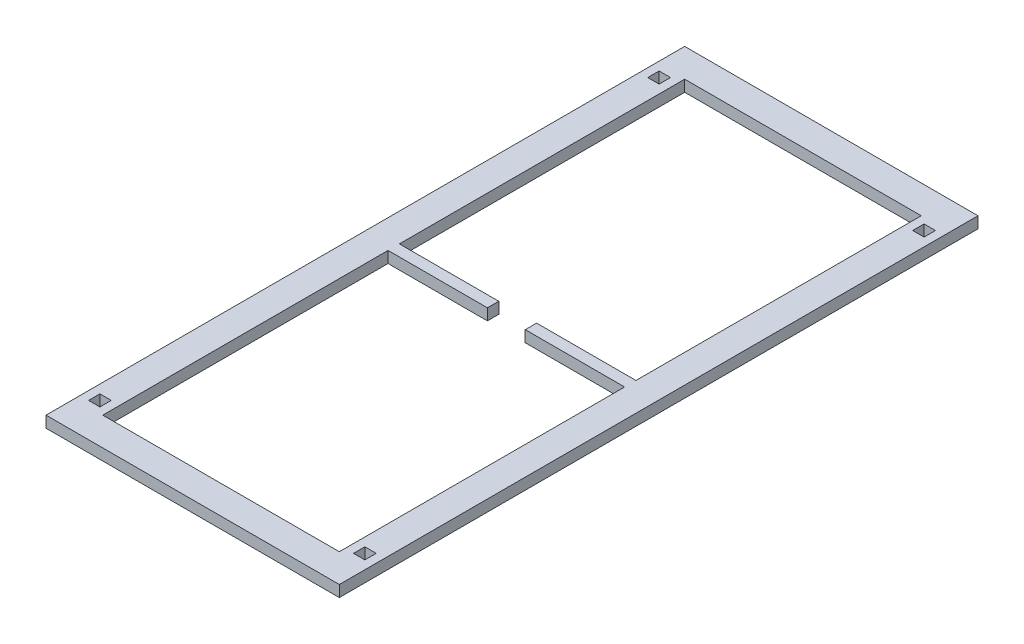
ISO-10303-21;
HEADER;
FILE_DESCRIPTION(('STEP AP214'),'2;1');
FILE_NAME('part.step','',(''),(''),'','','');
FILE_SCHEMA(('AUTOMOTIVE_DESIGN { 1 0 10303 214 1 1 1 1 }'));
ENDSEC;
DATA;
#1=APPLICATION_CONTEXT('core data for automotive mechanical design processes');
#2=APPLICATION_PROTOCOL_DEFINITION('international standard','automotive_design',2000,#1);
#3=PRODUCT_CONTEXT('',#1,'mechanical');
#4=PRODUCT('Part','Part','',(#3));
#5=PRODUCT_RELATED_PRODUCT_CATEGORY('part','',(#4));
#6=PRODUCT_DEFINITION_FORMATION('','',#4);
#7=PRODUCT_DEFINITION_CONTEXT('part definition',#1,'design');
#8=PRODUCT_DEFINITION('design','',#6,#7);
#9=PRODUCT_DEFINITION_SHAPE('','',#8);
#10=(LENGTH_UNIT() NAMED_UNIT(*) SI_UNIT(.MILLI.,.METRE.));
#11=(NAMED_UNIT(*) PLANE_ANGLE_UNIT() SI_UNIT($,.RADIAN.));
#12=(NAMED_UNIT(*) SI_UNIT($,.STERADIAN.) SOLID_ANGLE_UNIT());
#13=UNCERTAINTY_MEASURE_WITH_UNIT(LENGTH_MEASURE(1.E-05),#10,'distance_accuracy_value','');
#14=(GEOMETRIC_REPRESENTATION_CONTEXT(3) GLOBAL_UNCERTAINTY_ASSIGNED_CONTEXT((#13)) GLOBAL_UNIT_ASSIGNED_CONTEXT((#10,
#11,#12)) REPRESENTATION_CONTEXT('',''));
#15=CARTESIAN_POINT('',(0.,0.,0.));
#16=DIRECTION('',(0.,0.,1.));
#17=DIRECTION('',(1.,0.,0.));
#18=AXIS2_PLACEMENT_3D('',#15,#16,#17);
#19=CARTESIAN_POINT('',(125.,12.,0.));
#20=DIRECTION('',(-1.,0.,0.));
#21=DIRECTION('',(0.,0.,1.));
#22=AXIS2_PLACEMENT_3D('',#19,#20,#21);
#23=PLANE('',#22);
#24=DIRECTION('',(0.,0.,-1.));
#25=VECTOR('',#24,1.);
#26=CARTESIAN_POINT('',(125.,0.,0.));
#27=LINE('',#26,#25);
#28=CARTESIAN_POINT('',(125.,0.,-6.));
#29=VERTEX_POINT('',#28);
#30=CARTESIAN_POINT('',(125.,0.,-307.5));
#31=VERTEX_POINT('',#30);
#32=EDGE_CURVE('E66',#29,#31,#27,.T.);
#33=ORIENTED_EDGE('',*,*,#32,.F.);
#34=DIRECTION('',(0.,1.,0.));
#35=VECTOR('',#34,1.);
#36=CARTESIAN_POINT('',(125.,0.,-6.));
#37=LINE('',#36,#35);
#38=CARTESIAN_POINT('',(125.,12.,-6.));
#39=VERTEX_POINT('',#38);
#40=EDGE_CURVE('E290',#29,#39,#37,.T.);
#41=ORIENTED_EDGE('',*,*,#40,.T.);
#42=DIRECTION('',(0.,0.,-1.));
#43=VECTOR('',#42,1.);
#44=CARTESIAN_POINT('',(125.,12.,0.));
#45=LINE('',#44,#43);
#46=CARTESIAN_POINT('',(125.,12.,-307.5));
#47=VERTEX_POINT('',#46);
#48=EDGE_CURVE('E459',#39,#47,#45,.T.);
#49=ORIENTED_EDGE('',*,*,#48,.T.);
#50=DIRECTION('',(0.,-1.,0.));
#51=VECTOR('',#50,1.);
#52=CARTESIAN_POINT('',(125.,12.,-307.5));
#53=LINE('',#52,#51);
#54=EDGE_CURVE('E492',#47,#31,#53,.T.);
#55=ORIENTED_EDGE('',*,*,#54,.T.);
#56=EDGE_LOOP('',(#33,#41,#49,#55));
#57=FACE_BOUND('',#56,.T.);
#58=ADVANCED_FACE('F41',(#57),#23,.T.);
#59=CARTESIAN_POINT('',(-125.,12.,0.));
#60=DIRECTION('',(-1.,0.,0.));
#61=DIRECTION('',(0.,0.,1.));
#62=AXIS2_PLACEMENT_3D('',#59,#60,#61);
#63=PLANE('',#62);
#64=DIRECTION('',(0.,1.,0.));
#65=VECTOR('',#64,1.);
#66=CARTESIAN_POINT('',(-125.,0.,-6.));
#67=LINE('',#66,#65);
#68=CARTESIAN_POINT('',(-125.,0.,-6.));
#69=VERTEX_POINT('',#68);
#70=CARTESIAN_POINT('',(-125.,12.,-6.));
#71=VERTEX_POINT('',#70);
#72=EDGE_CURVE('E314',#69,#71,#67,.T.);
#73=ORIENTED_EDGE('',*,*,#72,.F.);
#74=DIRECTION('',(0.,0.,-1.));
#75=VECTOR('',#74,1.);
#76=CARTESIAN_POINT('',(-125.,0.,0.));
#77=LINE('',#76,#75);
#78=CARTESIAN_POINT('',(-125.,0.,-307.5));
#79=VERTEX_POINT('',#78);
#80=EDGE_CURVE('E486',#69,#79,#77,.T.);
#81=ORIENTED_EDGE('',*,*,#80,.T.);
#82=DIRECTION('',(0.,-1.,0.));
#83=VECTOR('',#82,1.);
#84=CARTESIAN_POINT('',(-125.,12.,-307.5));
#85=LINE('',#84,#83);
#86=CARTESIAN_POINT('',(-125.,12.,-307.5));
#87=VERTEX_POINT('',#86);
#88=EDGE_CURVE('E494',#87,#79,#85,.T.);
#89=ORIENTED_EDGE('',*,*,#88,.F.);
#90=DIRECTION('',(0.,0.,-1.));
#91=VECTOR('',#90,1.);
#92=CARTESIAN_POINT('',(-125.,12.,0.));
#93=LINE('',#92,#91);
#94=EDGE_CURVE('E464',#71,#87,#93,.T.);
#95=ORIENTED_EDGE('',*,*,#94,.F.);
#96=EDGE_LOOP('',(#73,#81,#89,#95));
#97=FACE_BOUND('',#96,.T.);
#98=ADVANCED_FACE('F530',(#97),#63,.F.);
#99=CARTESIAN_POINT('',(0.,12.,0.));
#100=DIRECTION('',(0.,1.,0.));
#101=DIRECTION('',(0.,0.,1.));
#102=AXIS2_PLACEMENT_3D('',#99,#100,#101);
#103=PLANE('',#102);
#104=DIRECTION('',(-1.,0.,0.));
#105=VECTOR('',#104,1.);
#106=CARTESIAN_POINT('',(0.,12.,337.5));
#107=LINE('',#106,#105);
#108=CARTESIAN_POINT('',(155.,12.,337.5));
#109=VERTEX_POINT('',#108);
#110=CARTESIAN_POINT('',(-155.,12.,337.5));
#111=VERTEX_POINT('',#110);
#112=EDGE_CURVE('E448',#109,#111,#107,.T.);
#113=ORIENTED_EDGE('',*,*,#112,.F.);
#114=DIRECTION('',(0.,0.,-1.));
#115=VECTOR('',#114,1.);
#116=CARTESIAN_POINT('',(155.,12.,0.));
#117=LINE('',#116,#115);
#118=CARTESIAN_POINT('',(155.,12.,-337.5));
#119=VERTEX_POINT('',#118);
#120=EDGE_CURVE('E451',#109,#119,#117,.T.);
#121=ORIENTED_EDGE('',*,*,#120,.T.);
#122=DIRECTION('',(-1.,0.,0.));
#123=VECTOR('',#122,1.);
#124=CARTESIAN_POINT('',(0.,12.,-337.5));
#125=LINE('',#124,#123);
#126=CARTESIAN_POINT('',(-155.,12.,-337.5));
#127=VERTEX_POINT('',#126);
#128=EDGE_CURVE('E454',#119,#127,#125,.T.);
#129=ORIENTED_EDGE('',*,*,#128,.T.);
#130=DIRECTION('',(0.,0.,-1.));
#131=VECTOR('',#130,1.);
#132=CARTESIAN_POINT('',(-155.,12.,0.));
#133=LINE('',#132,#131);
#134=EDGE_CURVE('E456',#111,#127,#133,.T.);
#135=ORIENTED_EDGE('',*,*,#134,.F.);
#136=EDGE_LOOP('',(#113,#121,#129,#135));
#137=FACE_BOUND('',#136,.T.);
#138=CARTESIAN_POINT('',(125.,12.,307.5));
#139=VERTEX_POINT('',#138);
#140=CARTESIAN_POINT('',(125.,12.,6.));
#141=VERTEX_POINT('',#140);
#142=EDGE_CURVE('E58',#139,#141,#45,.T.);
#143=ORIENTED_EDGE('',*,*,#142,.F.);
#144=DIRECTION('',(-1.,0.,0.));
#145=VECTOR('',#144,1.);
#146=CARTESIAN_POINT('',(0.,12.,307.5));
#147=LINE('',#146,#145);
#148=CARTESIAN_POINT('',(-125.,12.,307.5));
#149=VERTEX_POINT('',#148);
#150=EDGE_CURVE('E461',#139,#149,#147,.T.);
#151=ORIENTED_EDGE('',*,*,#150,.T.);
#152=CARTESIAN_POINT('',(-125.,12.,6.));
#153=VERTEX_POINT('',#152);
#154=EDGE_CURVE('E465',#149,#153,#93,.T.);
#155=ORIENTED_EDGE('',*,*,#154,.T.);
#156=DIRECTION('',(1.,0.,0.));
#157=VECTOR('',#156,1.);
#158=CARTESIAN_POINT('',(0.,12.,6.));
#159=LINE('',#158,#157);
#160=CARTESIAN_POINT('',(-20.,12.,6.));
#161=VERTEX_POINT('',#160);
#162=EDGE_CURVE('E289',#153,#161,#159,.T.);
#163=ORIENTED_EDGE('',*,*,#162,.T.);
#164=DIRECTION('',(0.,0.,-1.));
#165=VECTOR('',#164,1.);
#166=CARTESIAN_POINT('',(-20.,12.,0.));
#167=LINE('',#166,#165);
#168=CARTESIAN_POINT('',(-20.,12.,-6.));
#169=VERTEX_POINT('',#168);
#170=EDGE_CURVE('E305',#161,#169,#167,.T.);
#171=ORIENTED_EDGE('',*,*,#170,.T.);
#172=DIRECTION('',(1.,0.,0.));
#173=VECTOR('',#172,1.);
#174=CARTESIAN_POINT('',(0.,12.,-6.));
#175=LINE('',#174,#173);
#176=EDGE_CURVE('E297',#71,#169,#175,.T.);
#177=ORIENTED_EDGE('',*,*,#176,.F.);
#178=ORIENTED_EDGE('',*,*,#94,.T.);
#179=DIRECTION('',(-1.,0.,0.));
#180=VECTOR('',#179,1.);
#181=CARTESIAN_POINT('',(0.,12.,-307.5));
#182=LINE('',#181,#180);
#183=EDGE_CURVE('E468',#47,#87,#182,.T.);
#184=ORIENTED_EDGE('',*,*,#183,.F.);
#185=ORIENTED_EDGE('',*,*,#48,.F.);
#186=DIRECTION('',(1.,0.,0.));
#187=VECTOR('',#186,1.);
#188=CARTESIAN_POINT('',(0.,12.,-6.));
#189=LINE('',#188,#187);
#190=CARTESIAN_POINT('',(20.,12.,-6.));
#191=VERTEX_POINT('',#190);
#192=EDGE_CURVE('E272',#191,#39,#189,.T.);
#193=ORIENTED_EDGE('',*,*,#192,.F.);
#194=DIRECTION('',(0.,0.,-1.));
#195=VECTOR('',#194,1.);
#196=CARTESIAN_POINT('',(20.,12.,0.));
#197=LINE('',#196,#195);
#198=CARTESIAN_POINT('',(20.,12.,6.));
#199=VERTEX_POINT('',#198);
#200=EDGE_CURVE('E283',#199,#191,#197,.T.);
#201=ORIENTED_EDGE('',*,*,#200,.F.);
#202=DIRECTION('',(1.,0.,0.));
#203=VECTOR('',#202,1.);
#204=CARTESIAN_POINT('',(0.,12.,6.));
#205=LINE('',#204,#203);
#206=EDGE_CURVE('E258',#199,#141,#205,.T.);
#207=ORIENTED_EDGE('',*,*,#206,.T.);
#208=EDGE_LOOP('',(#143,#151,#155,#163,#171,#177,#178,#184,#185,#193,#201,#207));
#209=FACE_BOUND('',#208,.T.);
#210=DIRECTION('',(1.,0.,0.));
#211=VECTOR('',#210,1.);
#212=CARTESIAN_POINT('',(0.,12.,289.5));
#213=LINE('',#212,#211);
#214=CARTESIAN_POINT('',(-146.,12.,289.5));
#215=VERTEX_POINT('',#214);
#216=CARTESIAN_POINT('',(-134.,12.,289.5));
#217=VERTEX_POINT('',#216);
#218=EDGE_CURVE('E399',#215,#217,#213,.T.);
#219=ORIENTED_EDGE('',*,*,#218,.T.);
#220=DIRECTION('',(0.,0.,1.));
#221=VECTOR('',#220,1.);
#222=CARTESIAN_POINT('',(-134.,12.,0.));
#223=LINE('',#222,#221);
#224=CARTESIAN_POINT('',(-134.,12.,301.5));
#225=VERTEX_POINT('',#224);
#226=EDGE_CURVE('E408',#217,#225,#223,.T.);
#227=ORIENTED_EDGE('',*,*,#226,.T.);
#228=DIRECTION('',(-1.,0.,0.));
#229=VECTOR('',#228,1.);
#230=CARTESIAN_POINT('',(0.,12.,301.5));
#231=LINE('',#230,#229);
#232=CARTESIAN_POINT('',(-146.,12.,301.5));
#233=VERTEX_POINT('',#232);
#234=EDGE_CURVE('E405',#225,#233,#231,.T.);
#235=ORIENTED_EDGE('',*,*,#234,.T.);
#236=DIRECTION('',(0.,0.,-1.));
#237=VECTOR('',#236,1.);
#238=CARTESIAN_POINT('',(-146.,12.,0.));
#239=LINE('',#238,#237);
#240=EDGE_CURVE('E402',#233,#215,#239,.T.);
#241=ORIENTED_EDGE('',*,*,#240,.T.);
#242=EDGE_LOOP('',(#219,#227,#235,#241));
#243=FACE_BOUND('',#242,.T.);
#244=DIRECTION('',(1.,0.,0.));
#245=VECTOR('',#244,1.);
#246=CARTESIAN_POINT('',(0.,12.,-301.5));
#247=LINE('',#246,#245);
#248=CARTESIAN_POINT('',(-146.,12.,-301.5));
#249=VERTEX_POINT('',#248);
#250=CARTESIAN_POINT('',(-134.,12.,-301.5));
#251=VERTEX_POINT('',#250);
#252=EDGE_CURVE('E411',#249,#251,#247,.T.);
#253=ORIENTED_EDGE('',*,*,#252,.T.);
#254=DIRECTION('',(0.,0.,1.));
#255=VECTOR('',#254,1.);
#256=CARTESIAN_POINT('',(-134.,12.,0.));
#257=LINE('',#256,#255);
#258=CARTESIAN_POINT('',(-134.,12.,-289.5));
#259=VERTEX_POINT('',#258);
#260=EDGE_CURVE('E420',#251,#259,#257,.T.);
#261=ORIENTED_EDGE('',*,*,#260,.T.);
#262=DIRECTION('',(-1.,0.,0.));
#263=VECTOR('',#262,1.);
#264=CARTESIAN_POINT('',(0.,12.,-289.5));
#265=LINE('',#264,#263);
#266=CARTESIAN_POINT('',(-146.,12.,-289.5));
#267=VERTEX_POINT('',#266);
#268=EDGE_CURVE('E417',#259,#267,#265,.T.);
#269=ORIENTED_EDGE('',*,*,#268,.T.);
#270=DIRECTION('',(0.,0.,-1.));
#271=VECTOR('',#270,1.);
#272=CARTESIAN_POINT('',(-146.,12.,0.));
#273=LINE('',#272,#271);
#274=EDGE_CURVE('E414',#267,#249,#273,.T.);
#275=ORIENTED_EDGE('',*,*,#274,.T.);
#276=EDGE_LOOP('',(#253,#261,#269,#275));
#277=FACE_BOUND('',#276,.T.);
#278=DIRECTION('',(1.,0.,0.));
#279=VECTOR('',#278,1.);
#280=CARTESIAN_POINT('',(0.,12.,-301.5));
#281=LINE('',#280,#279);
#282=CARTESIAN_POINT('',(134.,12.,-301.5));
#283=VERTEX_POINT('',#282);
#284=CARTESIAN_POINT('',(146.,12.,-301.5));
#285=VERTEX_POINT('',#284);
#286=EDGE_CURVE('E423',#283,#285,#281,.T.);
#287=ORIENTED_EDGE('',*,*,#286,.T.);
#288=DIRECTION('',(0.,0.,1.));
#289=VECTOR('',#288,1.);
#290=CARTESIAN_POINT('',(146.,12.,0.));
#291=LINE('',#290,#289);
#292=CARTESIAN_POINT('',(146.,12.,-289.5));
#293=VERTEX_POINT('',#292);
#294=EDGE_CURVE('E432',#285,#293,#291,.T.);
#295=ORIENTED_EDGE('',*,*,#294,.T.);
#296=DIRECTION('',(-1.,0.,0.));
#297=VECTOR('',#296,1.);
#298=CARTESIAN_POINT('',(0.,12.,-289.5));
#299=LINE('',#298,#297);
#300=CARTESIAN_POINT('',(134.,12.,-289.5));
#301=VERTEX_POINT('',#300);
#302=EDGE_CURVE('E429',#293,#301,#299,.T.);
#303=ORIENTED_EDGE('',*,*,#302,.T.);
#304=DIRECTION('',(0.,0.,-1.));
#305=VECTOR('',#304,1.);
#306=CARTESIAN_POINT('',(134.,12.,0.));
#307=LINE('',#306,#305);
#308=EDGE_CURVE('E426',#301,#283,#307,.T.);
#309=ORIENTED_EDGE('',*,*,#308,.T.);
#310=EDGE_LOOP('',(#287,#295,#303,#309));
#311=FACE_BOUND('',#310,.T.);
#312=DIRECTION('',(1.,0.,0.));
#313=VECTOR('',#312,1.);
#314=CARTESIAN_POINT('',(0.,12.,289.5));
#315=LINE('',#314,#313);
#316=CARTESIAN_POINT('',(134.,12.,289.5));
#317=VERTEX_POINT('',#316);
#318=CARTESIAN_POINT('',(146.,12.,289.5));
#319=VERTEX_POINT('',#318);
#320=EDGE_CURVE('E435',#317,#319,#315,.T.);
#321=ORIENTED_EDGE('',*,*,#320,.T.);
#322=DIRECTION('',(0.,0.,1.));
#323=VECTOR('',#322,1.);
#324=CARTESIAN_POINT('',(146.,12.,0.));
#325=LINE('',#324,#323);
#326=CARTESIAN_POINT('',(146.,12.,301.5));
#327=VERTEX_POINT('',#326);
#328=EDGE_CURVE('E444',#319,#327,#325,.T.);
#329=ORIENTED_EDGE('',*,*,#328,.T.);
#330=DIRECTION('',(-1.,0.,0.));
#331=VECTOR('',#330,1.);
#332=CARTESIAN_POINT('',(0.,12.,301.5));
#333=LINE('',#332,#331);
#334=CARTESIAN_POINT('',(134.,12.,301.5));
#335=VERTEX_POINT('',#334);
#336=EDGE_CURVE('E441',#327,#335,#333,.T.);
#337=ORIENTED_EDGE('',*,*,#336,.T.);
#338=DIRECTION('',(0.,0.,-1.));
#339=VECTOR('',#338,1.);
#340=CARTESIAN_POINT('',(134.,12.,0.));
#341=LINE('',#340,#339);
#342=EDGE_CURVE('E438',#335,#317,#341,.T.);
#343=ORIENTED_EDGE('',*,*,#342,.T.);
#344=EDGE_LOOP('',(#321,#329,#337,#343));
#345=FACE_BOUND('',#344,.T.);
#346=ADVANCED_FACE('F536',(#137,#209,#243,#277,#311,#345),#103,.T.);
#347=CARTESIAN_POINT('',(0.,0.,0.));
#348=DIRECTION('',(0.,1.,0.));
#349=DIRECTION('',(0.,0.,1.));
#350=AXIS2_PLACEMENT_3D('',#347,#348,#349);
#351=PLANE('',#350);
#352=DIRECTION('',(0.,0.,1.));
#353=VECTOR('',#352,1.);
#354=CARTESIAN_POINT('',(146.,0.,0.));
#355=LINE('',#354,#353);
#356=CARTESIAN_POINT('',(146.,0.,-301.5));
#357=VERTEX_POINT('',#356);
#358=CARTESIAN_POINT('',(146.,0.,-289.5));
#359=VERTEX_POINT('',#358);
#360=EDGE_CURVE('E324',#357,#359,#355,.T.);
#361=ORIENTED_EDGE('',*,*,#360,.F.);
#362=DIRECTION('',(1.,0.,0.));
#363=VECTOR('',#362,1.);
#364=CARTESIAN_POINT('',(0.,0.,-301.5));
#365=LINE('',#364,#363);
#366=CARTESIAN_POINT('',(134.,0.,-301.5));
#367=VERTEX_POINT('',#366);
#368=EDGE_CURVE('E354',#367,#357,#365,.T.);
#369=ORIENTED_EDGE('',*,*,#368,.F.);
#370=DIRECTION('',(0.,0.,-1.));
#371=VECTOR('',#370,1.);
#372=CARTESIAN_POINT('',(134.,0.,0.));
#373=LINE('',#372,#371);
#374=CARTESIAN_POINT('',(134.,0.,-289.5));
#375=VERTEX_POINT('',#374);
#376=EDGE_CURVE('E356',#375,#367,#373,.T.);
#377=ORIENTED_EDGE('',*,*,#376,.F.);
#378=DIRECTION('',(-1.,0.,0.));
#379=VECTOR('',#378,1.);
#380=CARTESIAN_POINT('',(0.,0.,-289.5));
#381=LINE('',#380,#379);
#382=EDGE_CURVE('E359',#359,#375,#381,.T.);
#383=ORIENTED_EDGE('',*,*,#382,.F.);
#384=EDGE_LOOP('',(#361,#369,#377,#383));
#385=FACE_BOUND('',#384,.T.);
#386=DIRECTION('',(0.,0.,1.));
#387=VECTOR('',#386,1.);
#388=CARTESIAN_POINT('',(-134.,0.,0.));
#389=LINE('',#388,#387);
#390=CARTESIAN_POINT('',(-134.,0.,289.5));
#391=VERTEX_POINT('',#390);
#392=CARTESIAN_POINT('',(-134.,0.,301.5));
#393=VERTEX_POINT('',#392);
#394=EDGE_CURVE('E341',#391,#393,#389,.T.);
#395=ORIENTED_EDGE('',*,*,#394,.F.);
#396=DIRECTION('',(1.,0.,0.));
#397=VECTOR('',#396,1.);
#398=CARTESIAN_POINT('',(0.,0.,289.5));
#399=LINE('',#398,#397);
#400=CARTESIAN_POINT('',(-146.,0.,289.5));
#401=VERTEX_POINT('',#400);
#402=EDGE_CURVE('E386',#401,#391,#399,.T.);
#403=ORIENTED_EDGE('',*,*,#402,.F.);
#404=DIRECTION('',(0.,0.,-1.));
#405=VECTOR('',#404,1.);
#406=CARTESIAN_POINT('',(-146.,0.,0.));
#407=LINE('',#406,#405);
#408=CARTESIAN_POINT('',(-146.,0.,301.5));
#409=VERTEX_POINT('',#408);
#410=EDGE_CURVE('E383',#409,#401,#407,.T.);
#411=ORIENTED_EDGE('',*,*,#410,.F.);
#412=DIRECTION('',(-1.,0.,0.));
#413=VECTOR('',#412,1.);
#414=CARTESIAN_POINT('',(0.,0.,301.5));
#415=LINE('',#414,#413);
#416=EDGE_CURVE('E381',#393,#409,#415,.T.);
#417=ORIENTED_EDGE('',*,*,#416,.F.);
#418=EDGE_LOOP('',(#395,#403,#411,#417));
#419=FACE_BOUND('',#418,.T.);
#420=DIRECTION('',(-1.,0.,0.));
#421=VECTOR('',#420,1.);
#422=CARTESIAN_POINT('',(0.,0.,337.5));
#423=LINE('',#422,#421);
#424=CARTESIAN_POINT('',(155.,0.,337.5));
#425=VERTEX_POINT('',#424);
#426=CARTESIAN_POINT('',(-155.,0.,337.5));
#427=VERTEX_POINT('',#426);
#428=EDGE_CURVE('E447',#425,#427,#423,.T.);
#429=ORIENTED_EDGE('',*,*,#428,.T.);
#430=DIRECTION('',(0.,0.,-1.));
#431=VECTOR('',#430,1.);
#432=CARTESIAN_POINT('',(-155.,0.,0.));
#433=LINE('',#432,#431);
#434=CARTESIAN_POINT('',(-155.,0.,-337.5));
#435=VERTEX_POINT('',#434);
#436=EDGE_CURVE('E479',#427,#435,#433,.T.);
#437=ORIENTED_EDGE('',*,*,#436,.T.);
#438=DIRECTION('',(-1.,0.,0.));
#439=VECTOR('',#438,1.);
#440=CARTESIAN_POINT('',(0.,0.,-337.5));
#441=LINE('',#440,#439);
#442=CARTESIAN_POINT('',(155.,0.,-337.5));
#443=VERTEX_POINT('',#442);
#444=EDGE_CURVE('E476',#443,#435,#441,.T.);
#445=ORIENTED_EDGE('',*,*,#444,.F.);
#446=DIRECTION('',(0.,0.,-1.));
#447=VECTOR('',#446,1.);
#448=CARTESIAN_POINT('',(155.,0.,0.));
#449=LINE('',#448,#447);
#450=EDGE_CURVE('E474',#425,#443,#449,.T.);
#451=ORIENTED_EDGE('',*,*,#450,.F.);
#452=EDGE_LOOP('',(#429,#437,#445,#451));
#453=FACE_BOUND('',#452,.T.);
#454=CARTESIAN_POINT('',(125.,0.,307.5));
#455=VERTEX_POINT('',#454);
#456=CARTESIAN_POINT('',(125.,0.,6.));
#457=VERTEX_POINT('',#456);
#458=EDGE_CURVE('E279',#455,#457,#27,.T.);
#459=ORIENTED_EDGE('',*,*,#458,.T.);
#460=DIRECTION('',(1.,0.,0.));
#461=VECTOR('',#460,1.);
#462=CARTESIAN_POINT('',(0.,0.,6.));
#463=LINE('',#462,#461);
#464=CARTESIAN_POINT('',(20.,0.,6.));
#465=VERTEX_POINT('',#464);
#466=EDGE_CURVE('E256',#465,#457,#463,.T.);
#467=ORIENTED_EDGE('',*,*,#466,.F.);
#468=DIRECTION('',(0.,0.,-1.));
#469=VECTOR('',#468,1.);
#470=CARTESIAN_POINT('',(20.,0.,0.));
#471=LINE('',#470,#469);
#472=CARTESIAN_POINT('',(20.,0.,-6.));
#473=VERTEX_POINT('',#472);
#474=EDGE_CURVE('E267',#465,#473,#471,.T.);
#475=ORIENTED_EDGE('',*,*,#474,.T.);
#476=DIRECTION('',(1.,0.,0.));
#477=VECTOR('',#476,1.);
#478=CARTESIAN_POINT('',(0.,0.,-6.));
#479=LINE('',#478,#477);
#480=EDGE_CURVE('E263',#473,#29,#479,.T.);
#481=ORIENTED_EDGE('',*,*,#480,.T.);
#482=ORIENTED_EDGE('',*,*,#32,.T.);
#483=DIRECTION('',(-1.,0.,0.));
#484=VECTOR('',#483,1.);
#485=CARTESIAN_POINT('',(0.,0.,-307.5));
#486=LINE('',#485,#484);
#487=EDGE_CURVE('E452',#31,#79,#486,.T.);
#488=ORIENTED_EDGE('',*,*,#487,.T.);
#489=ORIENTED_EDGE('',*,*,#80,.F.);
#490=DIRECTION('',(1.,0.,0.));
#491=VECTOR('',#490,1.);
#492=CARTESIAN_POINT('',(0.,0.,-6.));
#493=LINE('',#492,#491);
#494=CARTESIAN_POINT('',(-20.,0.,-6.));
#495=VERTEX_POINT('',#494);
#496=EDGE_CURVE('E300',#69,#495,#493,.T.);
#497=ORIENTED_EDGE('',*,*,#496,.T.);
#498=DIRECTION('',(0.,0.,-1.));
#499=VECTOR('',#498,1.);
#500=CARTESIAN_POINT('',(-20.,0.,0.));
#501=LINE('',#500,#499);
#502=CARTESIAN_POINT('',(-20.,0.,6.));
#503=VERTEX_POINT('',#502);
#504=EDGE_CURVE('E296',#503,#495,#501,.T.);
#505=ORIENTED_EDGE('',*,*,#504,.F.);
#506=DIRECTION('',(1.,0.,0.));
#507=VECTOR('',#506,1.);
#508=CARTESIAN_POINT('',(0.,0.,6.));
#509=LINE('',#508,#507);
#510=CARTESIAN_POINT('',(-125.,0.,6.));
#511=VERTEX_POINT('',#510);
#512=EDGE_CURVE('E293',#511,#503,#509,.T.);
#513=ORIENTED_EDGE('',*,*,#512,.F.);
#514=CARTESIAN_POINT('',(-125.,0.,307.5));
#515=VERTEX_POINT('',#514);
#516=EDGE_CURVE('E487',#515,#511,#77,.T.);
#517=ORIENTED_EDGE('',*,*,#516,.F.);
#518=DIRECTION('',(-1.,0.,0.));
#519=VECTOR('',#518,1.);
#520=CARTESIAN_POINT('',(0.,0.,307.5));
#521=LINE('',#520,#519);
#522=EDGE_CURVE('E483',#455,#515,#521,.T.);
#523=ORIENTED_EDGE('',*,*,#522,.F.);
#524=EDGE_LOOP('',(#459,#467,#475,#481,#482,#488,#489,#497,#505,#513,#517,#523));
#525=FACE_BOUND('',#524,.T.);
#526=DIRECTION('',(0.,0.,1.));
#527=VECTOR('',#526,1.);
#528=CARTESIAN_POINT('',(-134.,0.,0.));
#529=LINE('',#528,#527);
#530=CARTESIAN_POINT('',(-134.,0.,-301.5));
#531=VERTEX_POINT('',#530);
#532=CARTESIAN_POINT('',(-134.,0.,-289.5));
#533=VERTEX_POINT('',#532);
#534=EDGE_CURVE('E339',#531,#533,#529,.T.);
#535=ORIENTED_EDGE('',*,*,#534,.F.);
#536=DIRECTION('',(1.,0.,0.));
#537=VECTOR('',#536,1.);
#538=CARTESIAN_POINT('',(0.,0.,-301.5));
#539=LINE('',#538,#537);
#540=CARTESIAN_POINT('',(-146.,0.,-301.5));
#541=VERTEX_POINT('',#540);
#542=EDGE_CURVE('E332',#541,#531,#539,.T.);
#543=ORIENTED_EDGE('',*,*,#542,.F.);
#544=DIRECTION('',(0.,0.,-1.));
#545=VECTOR('',#544,1.);
#546=CARTESIAN_POINT('',(-146.,0.,0.));
#547=LINE('',#546,#545);
#548=CARTESIAN_POINT('',(-146.,0.,-289.5));
#549=VERTEX_POINT('',#548);
#550=EDGE_CURVE('E334',#549,#541,#547,.T.);
#551=ORIENTED_EDGE('',*,*,#550,.F.);
#552=DIRECTION('',(-1.,0.,0.));
#553=VECTOR('',#552,1.);
#554=CARTESIAN_POINT('',(0.,0.,-289.5));
#555=LINE('',#554,#553);
#556=EDGE_CURVE('E337',#533,#549,#555,.T.);
#557=ORIENTED_EDGE('',*,*,#556,.F.);
#558=EDGE_LOOP('',(#535,#543,#551,#557));
#559=FACE_BOUND('',#558,.T.);
#560=DIRECTION('',(0.,0.,1.));
#561=VECTOR('',#560,1.);
#562=CARTESIAN_POINT('',(146.,0.,0.));
#563=LINE('',#562,#561);
#564=CARTESIAN_POINT('',(146.,0.,289.5));
#565=VERTEX_POINT('',#564);
#566=CARTESIAN_POINT('',(146.,0.,301.5));
#567=VERTEX_POINT('',#566);
#568=EDGE_CURVE('E346',#565,#567,#563,.T.);
#569=ORIENTED_EDGE('',*,*,#568,.F.);
#570=DIRECTION('',(1.,0.,0.));
#571=VECTOR('',#570,1.);
#572=CARTESIAN_POINT('',(0.,0.,289.5));
#573=LINE('',#572,#571);
#574=CARTESIAN_POINT('',(134.,0.,289.5));
#575=VERTEX_POINT('',#574);
#576=EDGE_CURVE('E372',#575,#565,#573,.T.);
#577=ORIENTED_EDGE('',*,*,#576,.F.);
#578=DIRECTION('',(0.,0.,-1.));
#579=VECTOR('',#578,1.);
#580=CARTESIAN_POINT('',(134.,0.,0.));
#581=LINE('',#580,#579);
#582=CARTESIAN_POINT('',(134.,0.,301.5));
#583=VERTEX_POINT('',#582);
#584=EDGE_CURVE('E374',#583,#575,#581,.T.);
#585=ORIENTED_EDGE('',*,*,#584,.F.);
#586=DIRECTION('',(-1.,0.,0.));
#587=VECTOR('',#586,1.);
#588=CARTESIAN_POINT('',(0.,0.,301.5));
#589=LINE('',#588,#587);
#590=EDGE_CURVE('E377',#567,#583,#589,.T.);
#591=ORIENTED_EDGE('',*,*,#590,.F.);
#592=EDGE_LOOP('',(#569,#577,#585,#591));
#593=FACE_BOUND('',#592,.T.);
#594=ADVANCED_FACE('F275',(#385,#419,#453,#525,#559,#593),#351,.F.);
#595=DIRECTION('',(0.,1.,0.));
#596=VECTOR('',#595,1.);
#597=CARTESIAN_POINT('',(125.,0.,6.));
#598=LINE('',#597,#596);
#599=EDGE_CURVE('E262',#457,#141,#598,.T.);
#600=ORIENTED_EDGE('',*,*,#599,.F.);
#601=ORIENTED_EDGE('',*,*,#458,.F.);
#602=DIRECTION('',(0.,-1.,0.));
#603=VECTOR('',#602,1.);
#604=CARTESIAN_POINT('',(125.,12.,307.5));
#605=LINE('',#604,#603);
#606=EDGE_CURVE('E11',#139,#455,#605,.T.);
#607=ORIENTED_EDGE('',*,*,#606,.F.);
#608=ORIENTED_EDGE('',*,*,#142,.T.);
#609=EDGE_LOOP('',(#600,#601,#607,#608));
#610=FACE_BOUND('',#609,.T.);
#611=ADVANCED_FACE('F532',(#610),#23,.T.);
#612=CARTESIAN_POINT('',(0.,12.,307.5));
#613=DIRECTION('',(0.,0.,1.));
#614=DIRECTION('',(1.,0.,0.));
#615=AXIS2_PLACEMENT_3D('',#612,#613,#614);
#616=PLANE('',#615);
#617=ORIENTED_EDGE('',*,*,#522,.T.);
#618=DIRECTION('',(0.,-1.,0.));
#619=VECTOR('',#618,1.);
#620=CARTESIAN_POINT('',(-125.,12.,307.5));
#621=LINE('',#620,#619);
#622=EDGE_CURVE('E50',#149,#515,#621,.T.);
#623=ORIENTED_EDGE('',*,*,#622,.F.);
#624=ORIENTED_EDGE('',*,*,#150,.F.);
#625=ORIENTED_EDGE('',*,*,#606,.T.);
#626=EDGE_LOOP('',(#617,#623,#624,#625));
#627=FACE_BOUND('',#626,.T.);
#628=ADVANCED_FACE('F542',(#627),#616,.F.);
#629=ORIENTED_EDGE('',*,*,#516,.T.);
#630=DIRECTION('',(0.,1.,0.));
#631=VECTOR('',#630,1.);
#632=CARTESIAN_POINT('',(-125.,0.,6.));
#633=LINE('',#632,#631);
#634=EDGE_CURVE('E310',#511,#153,#633,.T.);
#635=ORIENTED_EDGE('',*,*,#634,.T.);
#636=ORIENTED_EDGE('',*,*,#154,.F.);
#637=ORIENTED_EDGE('',*,*,#622,.T.);
#638=EDGE_LOOP('',(#629,#635,#636,#637));
#639=FACE_BOUND('',#638,.T.);
#640=ADVANCED_FACE('F539',(#639),#63,.F.);
#641=CARTESIAN_POINT('',(0.,12.,337.5));
#642=DIRECTION('',(0.,0.,1.));
#643=DIRECTION('',(1.,0.,0.));
#644=AXIS2_PLACEMENT_3D('',#641,#642,#643);
#645=PLANE('',#644);
#646=ORIENTED_EDGE('',*,*,#428,.F.);
#647=DIRECTION('',(0.,-1.,0.));
#648=VECTOR('',#647,1.);
#649=CARTESIAN_POINT('',(155.,12.,337.5));
#650=LINE('',#649,#648);
#651=EDGE_CURVE('E45',#109,#425,#650,.T.);
#652=ORIENTED_EDGE('',*,*,#651,.F.);
#653=ORIENTED_EDGE('',*,*,#112,.T.);
#654=DIRECTION('',(0.,-1.,0.));
#655=VECTOR('',#654,1.);
#656=CARTESIAN_POINT('',(-155.,12.,337.5));
#657=LINE('',#656,#655);
#658=EDGE_CURVE('E471',#111,#427,#657,.T.);
#659=ORIENTED_EDGE('',*,*,#658,.T.);
#660=EDGE_LOOP('',(#646,#652,#653,#659));
#661=FACE_BOUND('',#660,.T.);
#662=ADVANCED_FACE('F43',(#661),#645,.T.);
#663=CARTESIAN_POINT('',(155.,12.,0.));
#664=DIRECTION('',(-1.,0.,0.));
#665=DIRECTION('',(0.,0.,1.));
#666=AXIS2_PLACEMENT_3D('',#663,#664,#665);
#667=PLANE('',#666);
#668=ORIENTED_EDGE('',*,*,#450,.T.);
#669=DIRECTION('',(0.,-1.,0.));
#670=VECTOR('',#669,1.);
#671=CARTESIAN_POINT('',(155.,12.,-337.5));
#672=LINE('',#671,#670);
#673=EDGE_CURVE('E501',#119,#443,#672,.T.);
#674=ORIENTED_EDGE('',*,*,#673,.F.);
#675=ORIENTED_EDGE('',*,*,#120,.F.);
#676=ORIENTED_EDGE('',*,*,#651,.T.);
#677=EDGE_LOOP('',(#668,#674,#675,#676));
#678=FACE_BOUND('',#677,.T.);
#679=ADVANCED_FACE('F510',(#678),#667,.F.);
#680=CARTESIAN_POINT('',(0.,12.,-337.5));
#681=DIRECTION('',(0.,0.,1.));
#682=DIRECTION('',(1.,0.,0.));
#683=AXIS2_PLACEMENT_3D('',#680,#681,#682);
#684=PLANE('',#683);
#685=ORIENTED_EDGE('',*,*,#444,.T.);
#686=DIRECTION('',(0.,-1.,0.));
#687=VECTOR('',#686,1.);
#688=CARTESIAN_POINT('',(-155.,12.,-337.5));
#689=LINE('',#688,#687);
#690=EDGE_CURVE('E500',#127,#435,#689,.T.);
#691=ORIENTED_EDGE('',*,*,#690,.F.);
#692=ORIENTED_EDGE('',*,*,#128,.F.);
#693=ORIENTED_EDGE('',*,*,#673,.T.);
#694=EDGE_LOOP('',(#685,#691,#692,#693));
#695=FACE_BOUND('',#694,.T.);
#696=ADVANCED_FACE('F520',(#695),#684,.F.);
#697=CARTESIAN_POINT('',(-155.,12.,0.));
#698=DIRECTION('',(-1.,0.,0.));
#699=DIRECTION('',(0.,0.,1.));
#700=AXIS2_PLACEMENT_3D('',#697,#698,#699);
#701=PLANE('',#700);
#702=ORIENTED_EDGE('',*,*,#436,.F.);
#703=ORIENTED_EDGE('',*,*,#658,.F.);
#704=ORIENTED_EDGE('',*,*,#134,.T.);
#705=ORIENTED_EDGE('',*,*,#690,.T.);
#706=EDGE_LOOP('',(#702,#703,#704,#705));
#707=FACE_BOUND('',#706,.T.);
#708=ADVANCED_FACE('F518',(#707),#701,.T.);
#709=CARTESIAN_POINT('',(0.,12.,-307.5));
#710=DIRECTION('',(0.,0.,1.));
#711=DIRECTION('',(1.,0.,0.));
#712=AXIS2_PLACEMENT_3D('',#709,#710,#711);
#713=PLANE('',#712);
#714=ORIENTED_EDGE('',*,*,#487,.F.);
#715=ORIENTED_EDGE('',*,*,#54,.F.);
#716=ORIENTED_EDGE('',*,*,#183,.T.);
#717=ORIENTED_EDGE('',*,*,#88,.T.);
#718=EDGE_LOOP('',(#714,#715,#716,#717));
#719=FACE_BOUND('',#718,.T.);
#720=ADVANCED_FACE('F527',(#719),#713,.T.);
#721=CARTESIAN_POINT('',(-134.,0.,0.));
#722=DIRECTION('',(-1.,0.,0.));
#723=DIRECTION('',(0.,0.,1.));
#724=AXIS2_PLACEMENT_3D('',#721,#722,#723);
#725=PLANE('',#724);
#726=DIRECTION('',(0.,1.,0.));
#727=VECTOR('',#726,1.);
#728=CARTESIAN_POINT('',(-134.,0.,289.5));
#729=LINE('',#728,#727);
#730=EDGE_CURVE('E388',#391,#217,#729,.T.);
#731=ORIENTED_EDGE('',*,*,#730,.F.);
#732=ORIENTED_EDGE('',*,*,#394,.T.);
#733=DIRECTION('',(0.,1.,0.));
#734=VECTOR('',#733,1.);
#735=CARTESIAN_POINT('',(-134.,0.,301.5));
#736=LINE('',#735,#734);
#737=EDGE_CURVE('E396',#393,#225,#736,.T.);
#738=ORIENTED_EDGE('',*,*,#737,.T.);
#739=ORIENTED_EDGE('',*,*,#226,.F.);
#740=EDGE_LOOP('',(#731,#732,#738,#739));
#741=FACE_BOUND('',#740,.T.);
#742=ADVANCED_FACE('F582',(#741),#725,.T.);
#743=CARTESIAN_POINT('',(0.,0.,301.5));
#744=DIRECTION('',(0.,0.,-1.));
#745=DIRECTION('',(-1.,0.,0.));
#746=AXIS2_PLACEMENT_3D('',#743,#744,#745);
#747=PLANE('',#746);
#748=ORIENTED_EDGE('',*,*,#737,.F.);
#749=ORIENTED_EDGE('',*,*,#416,.T.);
#750=DIRECTION('',(0.,1.,0.));
#751=VECTOR('',#750,1.);
#752=CARTESIAN_POINT('',(-146.,0.,301.5));
#753=LINE('',#752,#751);
#754=EDGE_CURVE('E393',#409,#233,#753,.T.);
#755=ORIENTED_EDGE('',*,*,#754,.T.);
#756=ORIENTED_EDGE('',*,*,#234,.F.);
#757=EDGE_LOOP('',(#748,#749,#755,#756));
#758=FACE_BOUND('',#757,.T.);
#759=ADVANCED_FACE('F589',(#758),#747,.T.);
#760=CARTESIAN_POINT('',(-146.,0.,0.));
#761=DIRECTION('',(1.,0.,0.));
#762=DIRECTION('',(0.,0.,-1.));
#763=AXIS2_PLACEMENT_3D('',#760,#761,#762);
#764=PLANE('',#763);
#765=ORIENTED_EDGE('',*,*,#754,.F.);
#766=ORIENTED_EDGE('',*,*,#410,.T.);
#767=DIRECTION('',(0.,1.,0.));
#768=VECTOR('',#767,1.);
#769=CARTESIAN_POINT('',(-146.,0.,289.5));
#770=LINE('',#769,#768);
#771=EDGE_CURVE('E390',#401,#215,#770,.T.);
#772=ORIENTED_EDGE('',*,*,#771,.T.);
#773=ORIENTED_EDGE('',*,*,#240,.F.);
#774=EDGE_LOOP('',(#765,#766,#772,#773));
#775=FACE_BOUND('',#774,.T.);
#776=ADVANCED_FACE('F593',(#775),#764,.T.);
#777=CARTESIAN_POINT('',(0.,0.,289.5));
#778=DIRECTION('',(0.,0.,1.));
#779=DIRECTION('',(1.,0.,0.));
#780=AXIS2_PLACEMENT_3D('',#777,#778,#779);
#781=PLANE('',#780);
#782=ORIENTED_EDGE('',*,*,#771,.F.);
#783=ORIENTED_EDGE('',*,*,#402,.T.);
#784=ORIENTED_EDGE('',*,*,#730,.T.);
#785=ORIENTED_EDGE('',*,*,#218,.F.);
#786=EDGE_LOOP('',(#782,#783,#784,#785));
#787=FACE_BOUND('',#786,.T.);
#788=ADVANCED_FACE('F597',(#787),#781,.T.);
#789=CARTESIAN_POINT('',(-134.,0.,0.));
#790=DIRECTION('',(-1.,0.,0.));
#791=DIRECTION('',(0.,0.,1.));
#792=AXIS2_PLACEMENT_3D('',#789,#790,#791);
#793=PLANE('',#792);
#794=DIRECTION('',(0.,1.,0.));
#795=VECTOR('',#794,1.);
#796=CARTESIAN_POINT('',(-134.,0.,-301.5));
#797=LINE('',#796,#795);
#798=EDGE_CURVE('E330',#531,#251,#797,.T.);
#799=ORIENTED_EDGE('',*,*,#798,.F.);
#800=ORIENTED_EDGE('',*,*,#534,.T.);
#801=DIRECTION('',(0.,1.,0.));
#802=VECTOR('',#801,1.);
#803=CARTESIAN_POINT('',(-134.,0.,-289.5));
#804=LINE('',#803,#802);
#805=EDGE_CURVE('E320',#533,#259,#804,.T.);
#806=ORIENTED_EDGE('',*,*,#805,.T.);
#807=ORIENTED_EDGE('',*,*,#260,.F.);
#808=EDGE_LOOP('',(#799,#800,#806,#807));
#809=FACE_BOUND('',#808,.T.);
#810=ADVANCED_FACE('F601',(#809),#793,.T.);
#811=CARTESIAN_POINT('',(0.,0.,-289.5));
#812=DIRECTION('',(0.,0.,-1.));
#813=DIRECTION('',(-1.,0.,0.));
#814=AXIS2_PLACEMENT_3D('',#811,#812,#813);
#815=PLANE('',#814);
#816=ORIENTED_EDGE('',*,*,#805,.F.);
#817=ORIENTED_EDGE('',*,*,#556,.T.);
#818=DIRECTION('',(0.,1.,0.));
#819=VECTOR('',#818,1.);
#820=CARTESIAN_POINT('',(-146.,0.,-289.5));
#821=LINE('',#820,#819);
#822=EDGE_CURVE('E323',#549,#267,#821,.T.);
#823=ORIENTED_EDGE('',*,*,#822,.T.);
#824=ORIENTED_EDGE('',*,*,#268,.F.);
#825=EDGE_LOOP('',(#816,#817,#823,#824));
#826=FACE_BOUND('',#825,.T.);
#827=ADVANCED_FACE('F642',(#826),#815,.T.);
#828=CARTESIAN_POINT('',(-146.,0.,0.));
#829=DIRECTION('',(1.,0.,0.));
#830=DIRECTION('',(0.,0.,-1.));
#831=AXIS2_PLACEMENT_3D('',#828,#829,#830);
#832=PLANE('',#831);
#833=ORIENTED_EDGE('',*,*,#822,.F.);
#834=ORIENTED_EDGE('',*,*,#550,.T.);
#835=DIRECTION('',(0.,1.,0.));
#836=VECTOR('',#835,1.);
#837=CARTESIAN_POINT('',(-146.,0.,-301.5));
#838=LINE('',#837,#836);
#839=EDGE_CURVE('E327',#541,#249,#838,.T.);
#840=ORIENTED_EDGE('',*,*,#839,.T.);
#841=ORIENTED_EDGE('',*,*,#274,.F.);
#842=EDGE_LOOP('',(#833,#834,#840,#841));
#843=FACE_BOUND('',#842,.T.);
#844=ADVANCED_FACE('F638',(#843),#832,.T.);
#845=CARTESIAN_POINT('',(0.,0.,-301.5));
#846=DIRECTION('',(0.,0.,1.));
#847=DIRECTION('',(1.,0.,0.));
#848=AXIS2_PLACEMENT_3D('',#845,#846,#847);
#849=PLANE('',#848);
#850=ORIENTED_EDGE('',*,*,#839,.F.);
#851=ORIENTED_EDGE('',*,*,#542,.T.);
#852=ORIENTED_EDGE('',*,*,#798,.T.);
#853=ORIENTED_EDGE('',*,*,#252,.F.);
#854=EDGE_LOOP('',(#850,#851,#852,#853));
#855=FACE_BOUND('',#854,.T.);
#856=ADVANCED_FACE('F634',(#855),#849,.T.);
#857=CARTESIAN_POINT('',(146.,0.,0.));
#858=DIRECTION('',(-1.,0.,0.));
#859=DIRECTION('',(0.,0.,1.));
#860=AXIS2_PLACEMENT_3D('',#857,#858,#859);
#861=PLANE('',#860);
#862=DIRECTION('',(0.,1.,0.));
#863=VECTOR('',#862,1.);
#864=CARTESIAN_POINT('',(146.,0.,-301.5));
#865=LINE('',#864,#863);
#866=EDGE_CURVE('E352',#357,#285,#865,.T.);
#867=ORIENTED_EDGE('',*,*,#866,.F.);
#868=ORIENTED_EDGE('',*,*,#360,.T.);
#869=DIRECTION('',(0.,1.,0.));
#870=VECTOR('',#869,1.);
#871=CARTESIAN_POINT('',(146.,0.,-289.5));
#872=LINE('',#871,#870);
#873=EDGE_CURVE('E342',#359,#293,#872,.T.);
#874=ORIENTED_EDGE('',*,*,#873,.T.);
#875=ORIENTED_EDGE('',*,*,#294,.F.);
#876=EDGE_LOOP('',(#867,#868,#874,#875));
#877=FACE_BOUND('',#876,.T.);
#878=ADVANCED_FACE('F630',(#877),#861,.T.);
#879=CARTESIAN_POINT('',(0.,0.,-289.5));
#880=DIRECTION('',(0.,0.,-1.));
#881=DIRECTION('',(-1.,0.,0.));
#882=AXIS2_PLACEMENT_3D('',#879,#880,#881);
#883=PLANE('',#882);
#884=ORIENTED_EDGE('',*,*,#873,.F.);
#885=ORIENTED_EDGE('',*,*,#382,.T.);
#886=DIRECTION('',(0.,1.,0.));
#887=VECTOR('',#886,1.);
#888=CARTESIAN_POINT('',(134.,0.,-289.5));
#889=LINE('',#888,#887);
#890=EDGE_CURVE('E345',#375,#301,#889,.T.);
#891=ORIENTED_EDGE('',*,*,#890,.T.);
#892=ORIENTED_EDGE('',*,*,#302,.F.);
#893=EDGE_LOOP('',(#884,#885,#891,#892));
#894=FACE_BOUND('',#893,.T.);
#895=ADVANCED_FACE('F626',(#894),#883,.T.);
#896=CARTESIAN_POINT('',(134.,0.,0.));
#897=DIRECTION('',(1.,0.,0.));
#898=DIRECTION('',(0.,0.,-1.));
#899=AXIS2_PLACEMENT_3D('',#896,#897,#898);
#900=PLANE('',#899);
#901=ORIENTED_EDGE('',*,*,#890,.F.);
#902=ORIENTED_EDGE('',*,*,#376,.T.);
#903=DIRECTION('',(0.,1.,0.));
#904=VECTOR('',#903,1.);
#905=CARTESIAN_POINT('',(134.,0.,-301.5));
#906=LINE('',#905,#904);
#907=EDGE_CURVE('E349',#367,#283,#906,.T.);
#908=ORIENTED_EDGE('',*,*,#907,.T.);
#909=ORIENTED_EDGE('',*,*,#308,.F.);
#910=EDGE_LOOP('',(#901,#902,#908,#909));
#911=FACE_BOUND('',#910,.T.);
#912=ADVANCED_FACE('F622',(#911),#900,.T.);
#913=CARTESIAN_POINT('',(0.,0.,-301.5));
#914=DIRECTION('',(0.,0.,1.));
#915=DIRECTION('',(1.,0.,0.));
#916=AXIS2_PLACEMENT_3D('',#913,#914,#915);
#917=PLANE('',#916);
#918=ORIENTED_EDGE('',*,*,#907,.F.);
#919=ORIENTED_EDGE('',*,*,#368,.T.);
#920=ORIENTED_EDGE('',*,*,#866,.T.);
#921=ORIENTED_EDGE('',*,*,#286,.F.);
#922=EDGE_LOOP('',(#918,#919,#920,#921));
#923=FACE_BOUND('',#922,.T.);
#924=ADVANCED_FACE('F618',(#923),#917,.T.);
#925=CARTESIAN_POINT('',(146.,0.,0.));
#926=DIRECTION('',(-1.,0.,0.));
#927=DIRECTION('',(0.,0.,1.));
#928=AXIS2_PLACEMENT_3D('',#925,#926,#927);
#929=PLANE('',#928);
#930=DIRECTION('',(0.,1.,0.));
#931=VECTOR('',#930,1.);
#932=CARTESIAN_POINT('',(146.,0.,289.5));
#933=LINE('',#932,#931);
#934=EDGE_CURVE('E370',#565,#319,#933,.T.);
#935=ORIENTED_EDGE('',*,*,#934,.F.);
#936=ORIENTED_EDGE('',*,*,#568,.T.);
#937=DIRECTION('',(0.,1.,0.));
#938=VECTOR('',#937,1.);
#939=CARTESIAN_POINT('',(146.,0.,301.5));
#940=LINE('',#939,#938);
#941=EDGE_CURVE('E313',#567,#327,#940,.T.);
#942=ORIENTED_EDGE('',*,*,#941,.T.);
#943=ORIENTED_EDGE('',*,*,#328,.F.);
#944=EDGE_LOOP('',(#935,#936,#942,#943));
#945=FACE_BOUND('',#944,.T.);
#946=ADVANCED_FACE('F614',(#945),#929,.T.);
#947=CARTESIAN_POINT('',(0.,0.,301.5));
#948=DIRECTION('',(0.,0.,-1.));
#949=DIRECTION('',(-1.,0.,0.));
#950=AXIS2_PLACEMENT_3D('',#947,#948,#949);
#951=PLANE('',#950);
#952=ORIENTED_EDGE('',*,*,#941,.F.);
#953=ORIENTED_EDGE('',*,*,#590,.T.);
#954=DIRECTION('',(0.,1.,0.));
#955=VECTOR('',#954,1.);
#956=CARTESIAN_POINT('',(134.,0.,301.5));
#957=LINE('',#956,#955);
#958=EDGE_CURVE('E364',#583,#335,#957,.T.);
#959=ORIENTED_EDGE('',*,*,#958,.T.);
#960=ORIENTED_EDGE('',*,*,#336,.F.);
#961=EDGE_LOOP('',(#952,#953,#959,#960));
#962=FACE_BOUND('',#961,.T.);
#963=ADVANCED_FACE('F610',(#962),#951,.T.);
#964=CARTESIAN_POINT('',(134.,0.,0.));
#965=DIRECTION('',(1.,0.,0.));
#966=DIRECTION('',(0.,0.,-1.));
#967=AXIS2_PLACEMENT_3D('',#964,#965,#966);
#968=PLANE('',#967);
#969=ORIENTED_EDGE('',*,*,#958,.F.);
#970=ORIENTED_EDGE('',*,*,#584,.T.);
#971=DIRECTION('',(0.,1.,0.));
#972=VECTOR('',#971,1.);
#973=CARTESIAN_POINT('',(134.,0.,289.5));
#974=LINE('',#973,#972);
#975=EDGE_CURVE('E367',#575,#317,#974,.T.);
#976=ORIENTED_EDGE('',*,*,#975,.T.);
#977=ORIENTED_EDGE('',*,*,#342,.F.);
#978=EDGE_LOOP('',(#969,#970,#976,#977));
#979=FACE_BOUND('',#978,.T.);
#980=ADVANCED_FACE('F606',(#979),#968,.T.);
#981=CARTESIAN_POINT('',(0.,0.,289.5));
#982=DIRECTION('',(0.,0.,1.));
#983=DIRECTION('',(1.,0.,0.));
#984=AXIS2_PLACEMENT_3D('',#981,#982,#983);
#985=PLANE('',#984);
#986=ORIENTED_EDGE('',*,*,#975,.F.);
#987=ORIENTED_EDGE('',*,*,#576,.T.);
#988=ORIENTED_EDGE('',*,*,#934,.T.);
#989=ORIENTED_EDGE('',*,*,#320,.F.);
#990=EDGE_LOOP('',(#986,#987,#988,#989));
#991=FACE_BOUND('',#990,.T.);
#992=ADVANCED_FACE('F603',(#991),#985,.T.);
#993=CARTESIAN_POINT('',(0.,0.,6.));
#994=DIRECTION('',(0.,0.,1.));
#995=DIRECTION('',(1.,0.,0.));
#996=AXIS2_PLACEMENT_3D('',#993,#994,#995);
#997=PLANE('',#996);
#998=ORIENTED_EDGE('',*,*,#162,.F.);
#999=ORIENTED_EDGE('',*,*,#634,.F.);
#1000=ORIENTED_EDGE('',*,*,#512,.T.);
#1001=DIRECTION('',(0.,1.,0.));
#1002=VECTOR('',#1001,1.);
#1003=CARTESIAN_POINT('',(-20.,0.,6.));
#1004=LINE('',#1003,#1002);
#1005=EDGE_CURVE('E302',#503,#161,#1004,.T.);
#1006=ORIENTED_EDGE('',*,*,#1005,.T.);
#1007=EDGE_LOOP('',(#998,#999,#1000,#1006));
#1008=FACE_BOUND('',#1007,.T.);
#1009=ADVANCED_FACE('F572',(#1008),#997,.T.);
#1010=CARTESIAN_POINT('',(0.,0.,-6.));
#1011=DIRECTION('',(0.,0.,1.));
#1012=DIRECTION('',(1.,0.,0.));
#1013=AXIS2_PLACEMENT_3D('',#1010,#1011,#1012);
#1014=PLANE('',#1013);
#1015=ORIENTED_EDGE('',*,*,#176,.T.);
#1016=DIRECTION('',(0.,1.,0.));
#1017=VECTOR('',#1016,1.);
#1018=CARTESIAN_POINT('',(-20.,0.,-6.));
#1019=LINE('',#1018,#1017);
#1020=EDGE_CURVE('E317',#495,#169,#1019,.T.);
#1021=ORIENTED_EDGE('',*,*,#1020,.F.);
#1022=ORIENTED_EDGE('',*,*,#496,.F.);
#1023=ORIENTED_EDGE('',*,*,#72,.T.);
#1024=EDGE_LOOP('',(#1015,#1021,#1022,#1023));
#1025=FACE_BOUND('',#1024,.T.);
#1026=ADVANCED_FACE('F567',(#1025),#1014,.F.);
#1027=CARTESIAN_POINT('',(-20.,0.,0.));
#1028=DIRECTION('',(1.,0.,0.));
#1029=DIRECTION('',(0.,0.,-1.));
#1030=AXIS2_PLACEMENT_3D('',#1027,#1028,#1029);
#1031=PLANE('',#1030);
#1032=ORIENTED_EDGE('',*,*,#170,.F.);
#1033=ORIENTED_EDGE('',*,*,#1005,.F.);
#1034=ORIENTED_EDGE('',*,*,#504,.T.);
#1035=ORIENTED_EDGE('',*,*,#1020,.T.);
#1036=EDGE_LOOP('',(#1032,#1033,#1034,#1035));
#1037=FACE_BOUND('',#1036,.T.);
#1038=ADVANCED_FACE('F570',(#1037),#1031,.T.);
#1039=CARTESIAN_POINT('',(20.,0.,0.));
#1040=DIRECTION('',(1.,0.,0.));
#1041=DIRECTION('',(0.,0.,-1.));
#1042=AXIS2_PLACEMENT_3D('',#1039,#1040,#1041);
#1043=PLANE('',#1042);
#1044=ORIENTED_EDGE('',*,*,#200,.T.);
#1045=DIRECTION('',(0.,1.,0.));
#1046=VECTOR('',#1045,1.);
#1047=CARTESIAN_POINT('',(20.,0.,-6.));
#1048=LINE('',#1047,#1046);
#1049=EDGE_CURVE('E270',#473,#191,#1048,.T.);
#1050=ORIENTED_EDGE('',*,*,#1049,.F.);
#1051=ORIENTED_EDGE('',*,*,#474,.F.);
#1052=DIRECTION('',(0.,1.,0.));
#1053=VECTOR('',#1052,1.);
#1054=CARTESIAN_POINT('',(20.,0.,6.));
#1055=LINE('',#1054,#1053);
#1056=EDGE_CURVE('E252',#465,#199,#1055,.T.);
#1057=ORIENTED_EDGE('',*,*,#1056,.T.);
#1058=EDGE_LOOP('',(#1044,#1050,#1051,#1057));
#1059=FACE_BOUND('',#1058,.T.);
#1060=ADVANCED_FACE('F268',(#1059),#1043,.F.);
#1061=CARTESIAN_POINT('',(0.,0.,-6.));
#1062=DIRECTION('',(0.,0.,1.));
#1063=DIRECTION('',(1.,0.,0.));
#1064=AXIS2_PLACEMENT_3D('',#1061,#1062,#1063);
#1065=PLANE('',#1064);
#1066=ORIENTED_EDGE('',*,*,#192,.T.);
#1067=ORIENTED_EDGE('',*,*,#40,.F.);
#1068=ORIENTED_EDGE('',*,*,#480,.F.);
#1069=ORIENTED_EDGE('',*,*,#1049,.T.);
#1070=EDGE_LOOP('',(#1066,#1067,#1068,#1069));
#1071=FACE_BOUND('',#1070,.T.);
#1072=ADVANCED_FACE('F555',(#1071),#1065,.F.);
#1073=CARTESIAN_POINT('',(0.,0.,6.));
#1074=DIRECTION('',(0.,0.,1.));
#1075=DIRECTION('',(1.,0.,0.));
#1076=AXIS2_PLACEMENT_3D('',#1073,#1074,#1075);
#1077=PLANE('',#1076);
#1078=ORIENTED_EDGE('',*,*,#206,.F.);
#1079=ORIENTED_EDGE('',*,*,#1056,.F.);
#1080=ORIENTED_EDGE('',*,*,#466,.T.);
#1081=ORIENTED_EDGE('',*,*,#599,.T.);
#1082=EDGE_LOOP('',(#1078,#1079,#1080,#1081));
#1083=FACE_BOUND('',#1082,.T.);
#1084=ADVANCED_FACE('F254',(#1083),#1077,.T.);
#1085=CLOSED_SHELL('',(#58,#98,#346,#594,#611,#628,#640,#662,#679,#696,#708,#720,#742,#759,#776,
#788,#810,#827,#844,#856,#878,#895,#912,#924,#946,#963,#980,#992,#1009,#1026,#1038,#1060,#1072,#1084));
#1086=MANIFOLD_SOLID_BREP('B2',#1085);
#1087=ADVANCED_BREP_SHAPE_REPRESENTATION('',(#18,#1086),#14);
#1088=SHAPE_DEFINITION_REPRESENTATION(#9,#1087);
ENDSEC;
END-ISO-10303-21;
